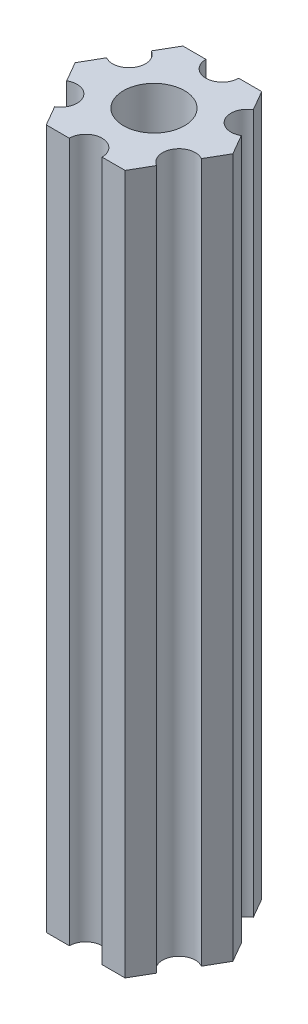
ISO-10303-21;
HEADER;
FILE_DESCRIPTION(('STEP AP214'),'2;1');
FILE_NAME('part.step','',(''),(''),'','','');
FILE_SCHEMA(('AUTOMOTIVE_DESIGN { 1 0 10303 214 1 1 1 1 }'));
ENDSEC;
DATA;
#1=APPLICATION_CONTEXT('core data for automotive mechanical design processes');
#2=APPLICATION_PROTOCOL_DEFINITION('international standard','automotive_design',2000,#1);
#3=PRODUCT_CONTEXT('',#1,'mechanical');
#4=PRODUCT('Part','Part','',(#3));
#5=PRODUCT_RELATED_PRODUCT_CATEGORY('part','',(#4));
#6=PRODUCT_DEFINITION_FORMATION('','',#4);
#7=PRODUCT_DEFINITION_CONTEXT('part definition',#1,'design');
#8=PRODUCT_DEFINITION('design','',#6,#7);
#9=PRODUCT_DEFINITION_SHAPE('','',#8);
#10=(LENGTH_UNIT() NAMED_UNIT(*) SI_UNIT(.MILLI.,.METRE.));
#11=(NAMED_UNIT(*) PLANE_ANGLE_UNIT() SI_UNIT($,.RADIAN.));
#12=(NAMED_UNIT(*) SI_UNIT($,.STERADIAN.) SOLID_ANGLE_UNIT());
#13=UNCERTAINTY_MEASURE_WITH_UNIT(LENGTH_MEASURE(1.E-05),#10,'distance_accuracy_value','');
#14=(GEOMETRIC_REPRESENTATION_CONTEXT(3) GLOBAL_UNCERTAINTY_ASSIGNED_CONTEXT((#13)) GLOBAL_UNIT_ASSIGNED_CONTEXT((#10,
#11,#12)) REPRESENTATION_CONTEXT('',''));
#15=CARTESIAN_POINT('',(0.,0.,0.));
#16=DIRECTION('',(0.,0.,1.));
#17=DIRECTION('',(1.,0.,0.));
#18=AXIS2_PLACEMENT_3D('',#15,#16,#17);
#19=CARTESIAN_POINT('',(5.41265877365274,21.,3.125));
#20=DIRECTION('',(0.,1.,0.));
#21=DIRECTION('',(0.,0.,1.));
#22=AXIS2_PLACEMENT_3D('',#19,#20,#21);
#23=CYLINDRICAL_SURFACE('',#22,1.5);
#24=CARTESIAN_POINT('',(5.41265877365274,85.,3.125));
#25=DIRECTION('',(0.,-1.,0.));
#26=DIRECTION('',(0.,0.,-1.));
#27=AXIS2_PLACEMENT_3D('',#24,#25,#26);
#28=CIRCLE('',#27,1.5);
#29=CARTESIAN_POINT('',(4.66265877365274,85.,4.42403810567666));
#30=VERTEX_POINT('',#29);
#31=CARTESIAN_POINT('',(6.16265877365274,85.,1.82596189432335));
#32=VERTEX_POINT('',#31);
#33=EDGE_CURVE('E189',#30,#32,#28,.T.);
#34=ORIENTED_EDGE('',*,*,#33,.F.);
#35=DIRECTION('',(0.,1.,0.));
#36=VECTOR('',#35,1.);
#37=CARTESIAN_POINT('',(4.66265877365274,21.,4.42403810567666));
#38=LINE('',#37,#36);
#39=CARTESIAN_POINT('',(4.66265877365274,21.,4.42403810567666));
#40=VERTEX_POINT('',#39);
#41=EDGE_CURVE('E11',#40,#30,#38,.T.);
#42=ORIENTED_EDGE('',*,*,#41,.F.);
#43=CARTESIAN_POINT('',(5.41265877365274,21.,3.125));
#44=DIRECTION('',(0.,-1.,0.));
#45=DIRECTION('',(0.,0.,-1.));
#46=AXIS2_PLACEMENT_3D('',#43,#44,#45);
#47=CIRCLE('',#46,1.5);
#48=CARTESIAN_POINT('',(6.16265877365274,21.,1.82596189432335));
#49=VERTEX_POINT('',#48);
#50=EDGE_CURVE('E240',#40,#49,#47,.T.);
#51=ORIENTED_EDGE('',*,*,#50,.T.);
#52=DIRECTION('',(0.,1.,0.));
#53=VECTOR('',#52,1.);
#54=CARTESIAN_POINT('',(6.16265877365274,21.,1.82596189432335));
#55=LINE('',#54,#53);
#56=EDGE_CURVE('E35',#49,#32,#55,.T.);
#57=ORIENTED_EDGE('',*,*,#56,.T.);
#58=EDGE_LOOP('',(#34,#42,#51,#57));
#59=FACE_BOUND('',#58,.T.);
#60=ADVANCED_FACE('F32',(#59),#23,.F.);
#61=CARTESIAN_POINT('',(3.60843918243516,21.,6.25));
#62=DIRECTION('',(0.866025403784439,0.,0.5));
#63=DIRECTION('',(0.5,0.,-0.866025403784439));
#64=AXIS2_PLACEMENT_3D('',#61,#62,#63);
#65=PLANE('',#64);
#66=DIRECTION('',(0.5,0.,-0.866025403784439));
#67=VECTOR('',#66,1.);
#68=CARTESIAN_POINT('',(3.60843918243516,85.,6.25));
#69=LINE('',#68,#67);
#70=CARTESIAN_POINT('',(3.60843918243516,85.,6.25));
#71=VERTEX_POINT('',#70);
#72=EDGE_CURVE('E238',#71,#30,#69,.T.);
#73=ORIENTED_EDGE('',*,*,#72,.F.);
#74=DIRECTION('',(0.,1.,0.));
#75=VECTOR('',#74,1.);
#76=CARTESIAN_POINT('',(3.60843918243516,21.,6.25));
#77=LINE('',#76,#75);
#78=CARTESIAN_POINT('',(3.60843918243516,21.,6.25));
#79=VERTEX_POINT('',#78);
#80=EDGE_CURVE('E41',#79,#71,#77,.T.);
#81=ORIENTED_EDGE('',*,*,#80,.F.);
#82=DIRECTION('',(0.5,0.,-0.866025403784439));
#83=VECTOR('',#82,1.);
#84=CARTESIAN_POINT('',(3.60843918243516,21.,6.25));
#85=LINE('',#84,#83);
#86=EDGE_CURVE('E179',#79,#40,#85,.T.);
#87=ORIENTED_EDGE('',*,*,#86,.T.);
#88=ORIENTED_EDGE('',*,*,#41,.T.);
#89=EDGE_LOOP('',(#73,#81,#87,#88));
#90=FACE_BOUND('',#89,.T.);
#91=ADVANCED_FACE('F272',(#90),#65,.T.);
#92=CARTESIAN_POINT('',(1.5,21.,6.25));
#93=DIRECTION('',(0.,0.,1.));
#94=DIRECTION('',(1.,0.,0.));
#95=AXIS2_PLACEMENT_3D('',#92,#93,#94);
#96=PLANE('',#95);
#97=DIRECTION('',(1.,0.,0.));
#98=VECTOR('',#97,1.);
#99=CARTESIAN_POINT('',(1.5,85.,6.25));
#100=LINE('',#99,#98);
#101=CARTESIAN_POINT('',(1.5,85.,6.25));
#102=VERTEX_POINT('',#101);
#103=EDGE_CURVE('E166',#102,#71,#100,.T.);
#104=ORIENTED_EDGE('',*,*,#103,.F.);
#105=DIRECTION('',(0.,1.,0.));
#106=VECTOR('',#105,1.);
#107=CARTESIAN_POINT('',(1.5,21.,6.25));
#108=LINE('',#107,#106);
#109=CARTESIAN_POINT('',(1.5,21.,6.25));
#110=VERTEX_POINT('',#109);
#111=EDGE_CURVE('E161',#110,#102,#108,.T.);
#112=ORIENTED_EDGE('',*,*,#111,.F.);
#113=DIRECTION('',(1.,0.,0.));
#114=VECTOR('',#113,1.);
#115=CARTESIAN_POINT('',(1.5,21.,6.25));
#116=LINE('',#115,#114);
#117=EDGE_CURVE('E164',#110,#79,#116,.T.);
#118=ORIENTED_EDGE('',*,*,#117,.T.);
#119=ORIENTED_EDGE('',*,*,#80,.T.);
#120=EDGE_LOOP('',(#104,#112,#118,#119));
#121=FACE_BOUND('',#120,.T.);
#122=ADVANCED_FACE('F163',(#121),#96,.T.);
#123=CARTESIAN_POINT('',(0.,21.,6.25));
#124=DIRECTION('',(0.,1.,0.));
#125=DIRECTION('',(0.,0.,1.));
#126=AXIS2_PLACEMENT_3D('',#123,#124,#125);
#127=CYLINDRICAL_SURFACE('',#126,1.5);
#128=CARTESIAN_POINT('',(0.,85.,6.25));
#129=DIRECTION('',(0.,-1.,0.));
#130=DIRECTION('',(0.,0.,-1.));
#131=AXIS2_PLACEMENT_3D('',#128,#129,#130);
#132=CIRCLE('',#131,1.5);
#133=CARTESIAN_POINT('',(-1.5,85.,6.25));
#134=VERTEX_POINT('',#133);
#135=EDGE_CURVE('E235',#134,#102,#132,.T.);
#136=ORIENTED_EDGE('',*,*,#135,.F.);
#137=DIRECTION('',(0.,1.,0.));
#138=VECTOR('',#137,1.);
#139=CARTESIAN_POINT('',(-1.5,21.,6.25));
#140=LINE('',#139,#138);
#141=CARTESIAN_POINT('',(-1.5,21.,6.25));
#142=VERTEX_POINT('',#141);
#143=EDGE_CURVE('E171',#142,#134,#140,.T.);
#144=ORIENTED_EDGE('',*,*,#143,.F.);
#145=CARTESIAN_POINT('',(0.,21.,6.25));
#146=DIRECTION('',(0.,-1.,0.));
#147=DIRECTION('',(0.,0.,-1.));
#148=AXIS2_PLACEMENT_3D('',#145,#146,#147);
#149=CIRCLE('',#148,1.5);
#150=EDGE_CURVE('E177',#142,#110,#149,.T.);
#151=ORIENTED_EDGE('',*,*,#150,.T.);
#152=ORIENTED_EDGE('',*,*,#111,.T.);
#153=EDGE_LOOP('',(#136,#144,#151,#152));
#154=FACE_BOUND('',#153,.T.);
#155=ADVANCED_FACE('F181',(#154),#127,.F.);
#156=CARTESIAN_POINT('',(-3.60843918243516,21.,6.25));
#157=DIRECTION('',(0.,0.,1.));
#158=DIRECTION('',(1.,0.,0.));
#159=AXIS2_PLACEMENT_3D('',#156,#157,#158);
#160=PLANE('',#159);
#161=DIRECTION('',(1.,0.,0.));
#162=VECTOR('',#161,1.);
#163=CARTESIAN_POINT('',(-3.60843918243516,85.,6.25));
#164=LINE('',#163,#162);
#165=CARTESIAN_POINT('',(-3.60843918243516,85.,6.25));
#166=VERTEX_POINT('',#165);
#167=EDGE_CURVE('E232',#166,#134,#164,.T.);
#168=ORIENTED_EDGE('',*,*,#167,.F.);
#169=DIRECTION('',(0.,1.,0.));
#170=VECTOR('',#169,1.);
#171=CARTESIAN_POINT('',(-3.60843918243516,21.,6.25));
#172=LINE('',#171,#170);
#173=CARTESIAN_POINT('',(-3.60843918243516,21.,6.25));
#174=VERTEX_POINT('',#173);
#175=EDGE_CURVE('E244',#174,#166,#172,.T.);
#176=ORIENTED_EDGE('',*,*,#175,.F.);
#177=DIRECTION('',(1.,0.,0.));
#178=VECTOR('',#177,1.);
#179=CARTESIAN_POINT('',(-3.60843918243516,21.,6.25));
#180=LINE('',#179,#178);
#181=EDGE_CURVE('E182',#174,#142,#180,.T.);
#182=ORIENTED_EDGE('',*,*,#181,.T.);
#183=ORIENTED_EDGE('',*,*,#143,.T.);
#184=EDGE_LOOP('',(#168,#176,#182,#183));
#185=FACE_BOUND('',#184,.T.);
#186=ADVANCED_FACE('F285',(#185),#160,.T.);
#187=CARTESIAN_POINT('',(-4.66265877365274,21.,4.42403810567666));
#188=DIRECTION('',(-0.866025403784439,0.,0.5));
#189=DIRECTION('',(0.5,0.,0.866025403784439));
#190=AXIS2_PLACEMENT_3D('',#187,#188,#189);
#191=PLANE('',#190);
#192=DIRECTION('',(0.5,0.,0.866025403784439));
#193=VECTOR('',#192,1.);
#194=CARTESIAN_POINT('',(-4.66265877365274,85.,4.42403810567666));
#195=LINE('',#194,#193);
#196=CARTESIAN_POINT('',(-4.66265877365274,85.,4.42403810567666));
#197=VERTEX_POINT('',#196);
#198=EDGE_CURVE('E229',#197,#166,#195,.T.);
#199=ORIENTED_EDGE('',*,*,#198,.F.);
#200=DIRECTION('',(0.,1.,0.));
#201=VECTOR('',#200,1.);
#202=CARTESIAN_POINT('',(-4.66265877365274,21.,4.42403810567666));
#203=LINE('',#202,#201);
#204=CARTESIAN_POINT('',(-4.66265877365274,21.,4.42403810567666));
#205=VERTEX_POINT('',#204);
#206=EDGE_CURVE('E246',#205,#197,#203,.T.);
#207=ORIENTED_EDGE('',*,*,#206,.F.);
#208=DIRECTION('',(0.5,0.,0.866025403784439));
#209=VECTOR('',#208,1.);
#210=CARTESIAN_POINT('',(-4.66265877365274,21.,4.42403810567666));
#211=LINE('',#210,#209);
#212=EDGE_CURVE('E184',#205,#174,#211,.T.);
#213=ORIENTED_EDGE('',*,*,#212,.T.);
#214=ORIENTED_EDGE('',*,*,#175,.T.);
#215=EDGE_LOOP('',(#199,#207,#213,#214));
#216=FACE_BOUND('',#215,.T.);
#217=ADVANCED_FACE('F288',(#216),#191,.T.);
#218=CARTESIAN_POINT('',(-5.41265877365274,21.,3.125));
#219=DIRECTION('',(0.,1.,0.));
#220=DIRECTION('',(0.,0.,1.));
#221=AXIS2_PLACEMENT_3D('',#218,#219,#220);
#222=CYLINDRICAL_SURFACE('',#221,1.5);
#223=CARTESIAN_POINT('',(-5.41265877365274,85.,3.125));
#224=DIRECTION('',(0.,-1.,0.));
#225=DIRECTION('',(0.,0.,-1.));
#226=AXIS2_PLACEMENT_3D('',#223,#224,#225);
#227=CIRCLE('',#226,1.5);
#228=CARTESIAN_POINT('',(-6.16265877365274,85.,1.82596189432335));
#229=VERTEX_POINT('',#228);
#230=EDGE_CURVE('E226',#229,#197,#227,.T.);
#231=ORIENTED_EDGE('',*,*,#230,.F.);
#232=DIRECTION('',(0.,1.,0.));
#233=VECTOR('',#232,1.);
#234=CARTESIAN_POINT('',(-6.16265877365274,21.,1.82596189432335));
#235=LINE('',#234,#233);
#236=CARTESIAN_POINT('',(-6.16265877365274,21.,1.82596189432335));
#237=VERTEX_POINT('',#236);
#238=EDGE_CURVE('E248',#237,#229,#235,.T.);
#239=ORIENTED_EDGE('',*,*,#238,.F.);
#240=CARTESIAN_POINT('',(-5.41265877365274,21.,3.125));
#241=DIRECTION('',(0.,-1.,0.));
#242=DIRECTION('',(0.,0.,-1.));
#243=AXIS2_PLACEMENT_3D('',#240,#241,#242);
#244=CIRCLE('',#243,1.5);
#245=EDGE_CURVE('E393',#237,#205,#244,.T.);
#246=ORIENTED_EDGE('',*,*,#245,.T.);
#247=ORIENTED_EDGE('',*,*,#206,.T.);
#248=EDGE_LOOP('',(#231,#239,#246,#247));
#249=FACE_BOUND('',#248,.T.);
#250=ADVANCED_FACE('F292',(#249),#222,.F.);
#251=CARTESIAN_POINT('',(-7.21687836487032,21.,0.));
#252=DIRECTION('',(-0.86602540378444,0.,0.499999999999998));
#253=DIRECTION('',(0.499999999999998,0.,0.86602540378444));
#254=AXIS2_PLACEMENT_3D('',#251,#252,#253);
#255=PLANE('',#254);
#256=DIRECTION('',(0.499999999999998,0.,0.86602540378444));
#257=VECTOR('',#256,1.);
#258=CARTESIAN_POINT('',(-7.21687836487032,85.,0.));
#259=LINE('',#258,#257);
#260=CARTESIAN_POINT('',(-7.21687836487032,85.,0.));
#261=VERTEX_POINT('',#260);
#262=EDGE_CURVE('E223',#261,#229,#259,.T.);
#263=ORIENTED_EDGE('',*,*,#262,.F.);
#264=DIRECTION('',(0.,1.,0.));
#265=VECTOR('',#264,1.);
#266=CARTESIAN_POINT('',(-7.21687836487032,21.,0.));
#267=LINE('',#266,#265);
#268=CARTESIAN_POINT('',(-7.21687836487032,21.,0.));
#269=VERTEX_POINT('',#268);
#270=EDGE_CURVE('E250',#269,#261,#267,.T.);
#271=ORIENTED_EDGE('',*,*,#270,.F.);
#272=DIRECTION('',(0.499999999999998,0.,0.86602540378444));
#273=VECTOR('',#272,1.);
#274=CARTESIAN_POINT('',(-7.21687836487032,21.,0.));
#275=LINE('',#274,#273);
#276=EDGE_CURVE('E390',#269,#237,#275,.T.);
#277=ORIENTED_EDGE('',*,*,#276,.T.);
#278=ORIENTED_EDGE('',*,*,#238,.T.);
#279=EDGE_LOOP('',(#263,#271,#277,#278));
#280=FACE_BOUND('',#279,.T.);
#281=ADVANCED_FACE('F296',(#280),#255,.T.);
#282=CARTESIAN_POINT('',(-6.16265877365274,21.,-1.82596189432334));
#283=DIRECTION('',(-0.866025403784438,0.,-0.5));
#284=DIRECTION('',(-0.5,0.,0.866025403784438));
#285=AXIS2_PLACEMENT_3D('',#282,#283,#284);
#286=PLANE('',#285);
#287=DIRECTION('',(-0.5,0.,0.866025403784438));
#288=VECTOR('',#287,1.);
#289=CARTESIAN_POINT('',(-6.16265877365274,85.,-1.82596189432334));
#290=LINE('',#289,#288);
#291=CARTESIAN_POINT('',(-6.16265877365274,85.,-1.82596189432334));
#292=VERTEX_POINT('',#291);
#293=EDGE_CURVE('E220',#292,#261,#290,.T.);
#294=ORIENTED_EDGE('',*,*,#293,.F.);
#295=DIRECTION('',(0.,1.,0.));
#296=VECTOR('',#295,1.);
#297=CARTESIAN_POINT('',(-6.16265877365274,21.,-1.82596189432334));
#298=LINE('',#297,#296);
#299=CARTESIAN_POINT('',(-6.16265877365274,21.,-1.82596189432334));
#300=VERTEX_POINT('',#299);
#301=EDGE_CURVE('E252',#300,#292,#298,.T.);
#302=ORIENTED_EDGE('',*,*,#301,.F.);
#303=DIRECTION('',(-0.5,0.,0.866025403784438));
#304=VECTOR('',#303,1.);
#305=CARTESIAN_POINT('',(-6.16265877365274,21.,-1.82596189432334));
#306=LINE('',#305,#304);
#307=EDGE_CURVE('E387',#300,#269,#306,.T.);
#308=ORIENTED_EDGE('',*,*,#307,.T.);
#309=ORIENTED_EDGE('',*,*,#270,.T.);
#310=EDGE_LOOP('',(#294,#302,#308,#309));
#311=FACE_BOUND('',#310,.T.);
#312=ADVANCED_FACE('F300',(#311),#286,.T.);
#313=CARTESIAN_POINT('',(-5.41265877365274,21.,-3.125));
#314=DIRECTION('',(0.,1.,0.));
#315=DIRECTION('',(0.,0.,1.));
#316=AXIS2_PLACEMENT_3D('',#313,#314,#315);
#317=CYLINDRICAL_SURFACE('',#316,1.5);
#318=CARTESIAN_POINT('',(-5.41265877365274,85.,-3.125));
#319=DIRECTION('',(0.,-1.,0.));
#320=DIRECTION('',(0.,0.,-1.));
#321=AXIS2_PLACEMENT_3D('',#318,#319,#320);
#322=CIRCLE('',#321,1.5);
#323=CARTESIAN_POINT('',(-4.66265877365274,85.,-4.42403810567666));
#324=VERTEX_POINT('',#323);
#325=EDGE_CURVE('E217',#324,#292,#322,.T.);
#326=ORIENTED_EDGE('',*,*,#325,.F.);
#327=DIRECTION('',(0.,1.,0.));
#328=VECTOR('',#327,1.);
#329=CARTESIAN_POINT('',(-4.66265877365274,21.,-4.42403810567666));
#330=LINE('',#329,#328);
#331=CARTESIAN_POINT('',(-4.66265877365274,21.,-4.42403810567666));
#332=VERTEX_POINT('',#331);
#333=EDGE_CURVE('E254',#332,#324,#330,.T.);
#334=ORIENTED_EDGE('',*,*,#333,.F.);
#335=CARTESIAN_POINT('',(-5.41265877365274,21.,-3.125));
#336=DIRECTION('',(0.,-1.,0.));
#337=DIRECTION('',(0.,0.,-1.));
#338=AXIS2_PLACEMENT_3D('',#335,#336,#337);
#339=CIRCLE('',#338,1.5);
#340=EDGE_CURVE('E384',#332,#300,#339,.T.);
#341=ORIENTED_EDGE('',*,*,#340,.T.);
#342=ORIENTED_EDGE('',*,*,#301,.T.);
#343=EDGE_LOOP('',(#326,#334,#341,#342));
#344=FACE_BOUND('',#343,.T.);
#345=ADVANCED_FACE('F304',(#344),#317,.F.);
#346=CARTESIAN_POINT('',(-3.60843918243516,21.,-6.25));
#347=DIRECTION('',(-0.866025403784439,0.,-0.5));
#348=DIRECTION('',(-0.5,0.,0.866025403784439));
#349=AXIS2_PLACEMENT_3D('',#346,#347,#348);
#350=PLANE('',#349);
#351=DIRECTION('',(-0.5,0.,0.866025403784439));
#352=VECTOR('',#351,1.);
#353=CARTESIAN_POINT('',(-3.60843918243516,85.,-6.25));
#354=LINE('',#353,#352);
#355=CARTESIAN_POINT('',(-3.60843918243516,85.,-6.25));
#356=VERTEX_POINT('',#355);
#357=EDGE_CURVE('E214',#356,#324,#354,.T.);
#358=ORIENTED_EDGE('',*,*,#357,.F.);
#359=DIRECTION('',(0.,1.,0.));
#360=VECTOR('',#359,1.);
#361=CARTESIAN_POINT('',(-3.60843918243516,21.,-6.25));
#362=LINE('',#361,#360);
#363=CARTESIAN_POINT('',(-3.60843918243516,21.,-6.25));
#364=VERTEX_POINT('',#363);
#365=EDGE_CURVE('E256',#364,#356,#362,.T.);
#366=ORIENTED_EDGE('',*,*,#365,.F.);
#367=DIRECTION('',(-0.5,0.,0.866025403784439));
#368=VECTOR('',#367,1.);
#369=CARTESIAN_POINT('',(-3.60843918243516,21.,-6.25));
#370=LINE('',#369,#368);
#371=EDGE_CURVE('E381',#364,#332,#370,.T.);
#372=ORIENTED_EDGE('',*,*,#371,.T.);
#373=ORIENTED_EDGE('',*,*,#333,.T.);
#374=EDGE_LOOP('',(#358,#366,#372,#373));
#375=FACE_BOUND('',#374,.T.);
#376=ADVANCED_FACE('F308',(#375),#350,.T.);
#377=CARTESIAN_POINT('',(-1.5,21.,-6.25));
#378=DIRECTION('',(0.,0.,-1.));
#379=DIRECTION('',(-1.,0.,0.));
#380=AXIS2_PLACEMENT_3D('',#377,#378,#379);
#381=PLANE('',#380);
#382=DIRECTION('',(-1.,0.,0.));
#383=VECTOR('',#382,1.);
#384=CARTESIAN_POINT('',(-1.5,85.,-6.25));
#385=LINE('',#384,#383);
#386=CARTESIAN_POINT('',(-1.5,85.,-6.25));
#387=VERTEX_POINT('',#386);
#388=EDGE_CURVE('E211',#387,#356,#385,.T.);
#389=ORIENTED_EDGE('',*,*,#388,.F.);
#390=DIRECTION('',(0.,1.,0.));
#391=VECTOR('',#390,1.);
#392=CARTESIAN_POINT('',(-1.5,21.,-6.25));
#393=LINE('',#392,#391);
#394=CARTESIAN_POINT('',(-1.5,21.,-6.25));
#395=VERTEX_POINT('',#394);
#396=EDGE_CURVE('E258',#395,#387,#393,.T.);
#397=ORIENTED_EDGE('',*,*,#396,.F.);
#398=DIRECTION('',(-1.,0.,0.));
#399=VECTOR('',#398,1.);
#400=CARTESIAN_POINT('',(-1.5,21.,-6.25));
#401=LINE('',#400,#399);
#402=EDGE_CURVE('E378',#395,#364,#401,.T.);
#403=ORIENTED_EDGE('',*,*,#402,.T.);
#404=ORIENTED_EDGE('',*,*,#365,.T.);
#405=EDGE_LOOP('',(#389,#397,#403,#404));
#406=FACE_BOUND('',#405,.T.);
#407=ADVANCED_FACE('F312',(#406),#381,.T.);
#408=CARTESIAN_POINT('',(0.,21.,-6.25));
#409=DIRECTION('',(0.,1.,0.));
#410=DIRECTION('',(0.,0.,1.));
#411=AXIS2_PLACEMENT_3D('',#408,#409,#410);
#412=CYLINDRICAL_SURFACE('',#411,1.5);
#413=CARTESIAN_POINT('',(0.,85.,-6.25));
#414=DIRECTION('',(0.,-1.,0.));
#415=DIRECTION('',(0.,0.,-1.));
#416=AXIS2_PLACEMENT_3D('',#413,#414,#415);
#417=CIRCLE('',#416,1.5);
#418=CARTESIAN_POINT('',(1.5,85.,-6.25));
#419=VERTEX_POINT('',#418);
#420=EDGE_CURVE('E208',#419,#387,#417,.T.);
#421=ORIENTED_EDGE('',*,*,#420,.F.);
#422=DIRECTION('',(0.,1.,0.));
#423=VECTOR('',#422,1.);
#424=CARTESIAN_POINT('',(1.5,21.,-6.25));
#425=LINE('',#424,#423);
#426=CARTESIAN_POINT('',(1.5,21.,-6.25));
#427=VERTEX_POINT('',#426);
#428=EDGE_CURVE('E260',#427,#419,#425,.T.);
#429=ORIENTED_EDGE('',*,*,#428,.F.);
#430=CARTESIAN_POINT('',(0.,21.,-6.25));
#431=DIRECTION('',(0.,-1.,0.));
#432=DIRECTION('',(0.,0.,-1.));
#433=AXIS2_PLACEMENT_3D('',#430,#431,#432);
#434=CIRCLE('',#433,1.5);
#435=EDGE_CURVE('E375',#427,#395,#434,.T.);
#436=ORIENTED_EDGE('',*,*,#435,.T.);
#437=ORIENTED_EDGE('',*,*,#396,.T.);
#438=EDGE_LOOP('',(#421,#429,#436,#437));
#439=FACE_BOUND('',#438,.T.);
#440=ADVANCED_FACE('F316',(#439),#412,.F.);
#441=CARTESIAN_POINT('',(3.60843918243516,21.,-6.25));
#442=DIRECTION('',(0.,0.,-1.));
#443=DIRECTION('',(-1.,0.,0.));
#444=AXIS2_PLACEMENT_3D('',#441,#442,#443);
#445=PLANE('',#444);
#446=DIRECTION('',(-1.,0.,0.));
#447=VECTOR('',#446,1.);
#448=CARTESIAN_POINT('',(3.60843918243516,85.,-6.25));
#449=LINE('',#448,#447);
#450=CARTESIAN_POINT('',(3.60843918243516,85.,-6.25));
#451=VERTEX_POINT('',#450);
#452=EDGE_CURVE('E205',#451,#419,#449,.T.);
#453=ORIENTED_EDGE('',*,*,#452,.F.);
#454=DIRECTION('',(0.,1.,0.));
#455=VECTOR('',#454,1.);
#456=CARTESIAN_POINT('',(3.60843918243516,21.,-6.25));
#457=LINE('',#456,#455);
#458=CARTESIAN_POINT('',(3.60843918243516,21.,-6.25));
#459=VERTEX_POINT('',#458);
#460=EDGE_CURVE('E262',#459,#451,#457,.T.);
#461=ORIENTED_EDGE('',*,*,#460,.F.);
#462=DIRECTION('',(-1.,0.,0.));
#463=VECTOR('',#462,1.);
#464=CARTESIAN_POINT('',(3.60843918243516,21.,-6.25));
#465=LINE('',#464,#463);
#466=EDGE_CURVE('E372',#459,#427,#465,.T.);
#467=ORIENTED_EDGE('',*,*,#466,.T.);
#468=ORIENTED_EDGE('',*,*,#428,.T.);
#469=EDGE_LOOP('',(#453,#461,#467,#468));
#470=FACE_BOUND('',#469,.T.);
#471=ADVANCED_FACE('F320',(#470),#445,.T.);
#472=CARTESIAN_POINT('',(4.66265877365274,21.,-4.42403810567666));
#473=DIRECTION('',(0.866025403784439,0.,-0.5));
#474=DIRECTION('',(-0.5,0.,-0.866025403784439));
#475=AXIS2_PLACEMENT_3D('',#472,#473,#474);
#476=PLANE('',#475);
#477=DIRECTION('',(-0.5,0.,-0.866025403784439));
#478=VECTOR('',#477,1.);
#479=CARTESIAN_POINT('',(4.66265877365274,85.,-4.42403810567666));
#480=LINE('',#479,#478);
#481=CARTESIAN_POINT('',(4.66265877365274,85.,-4.42403810567666));
#482=VERTEX_POINT('',#481);
#483=EDGE_CURVE('E202',#482,#451,#480,.T.);
#484=ORIENTED_EDGE('',*,*,#483,.F.);
#485=DIRECTION('',(0.,1.,0.));
#486=VECTOR('',#485,1.);
#487=CARTESIAN_POINT('',(4.66265877365274,21.,-4.42403810567666));
#488=LINE('',#487,#486);
#489=CARTESIAN_POINT('',(4.66265877365274,21.,-4.42403810567666));
#490=VERTEX_POINT('',#489);
#491=EDGE_CURVE('E264',#490,#482,#488,.T.);
#492=ORIENTED_EDGE('',*,*,#491,.F.);
#493=DIRECTION('',(-0.5,0.,-0.866025403784439));
#494=VECTOR('',#493,1.);
#495=CARTESIAN_POINT('',(4.66265877365274,21.,-4.42403810567666));
#496=LINE('',#495,#494);
#497=EDGE_CURVE('E369',#490,#459,#496,.T.);
#498=ORIENTED_EDGE('',*,*,#497,.T.);
#499=ORIENTED_EDGE('',*,*,#460,.T.);
#500=EDGE_LOOP('',(#484,#492,#498,#499));
#501=FACE_BOUND('',#500,.T.);
#502=ADVANCED_FACE('F324',(#501),#476,.T.);
#503=CARTESIAN_POINT('',(5.41265877365274,21.,-3.125));
#504=DIRECTION('',(0.,1.,0.));
#505=DIRECTION('',(0.,0.,1.));
#506=AXIS2_PLACEMENT_3D('',#503,#504,#505);
#507=CYLINDRICAL_SURFACE('',#506,1.5);
#508=CARTESIAN_POINT('',(5.41265877365274,85.,-3.125));
#509=DIRECTION('',(0.,-1.,0.));
#510=DIRECTION('',(0.,0.,-1.));
#511=AXIS2_PLACEMENT_3D('',#508,#509,#510);
#512=CIRCLE('',#511,1.5);
#513=CARTESIAN_POINT('',(6.16265877365274,85.,-1.82596189432334));
#514=VERTEX_POINT('',#513);
#515=EDGE_CURVE('E199',#514,#482,#512,.T.);
#516=ORIENTED_EDGE('',*,*,#515,.F.);
#517=DIRECTION('',(0.,1.,0.));
#518=VECTOR('',#517,1.);
#519=CARTESIAN_POINT('',(6.16265877365274,21.,-1.82596189432334));
#520=LINE('',#519,#518);
#521=CARTESIAN_POINT('',(6.16265877365274,21.,-1.82596189432334));
#522=VERTEX_POINT('',#521);
#523=EDGE_CURVE('E266',#522,#514,#520,.T.);
#524=ORIENTED_EDGE('',*,*,#523,.F.);
#525=CARTESIAN_POINT('',(5.41265877365274,21.,-3.125));
#526=DIRECTION('',(0.,-1.,0.));
#527=DIRECTION('',(0.,0.,-1.));
#528=AXIS2_PLACEMENT_3D('',#525,#526,#527);
#529=CIRCLE('',#528,1.5);
#530=EDGE_CURVE('E366',#522,#490,#529,.T.);
#531=ORIENTED_EDGE('',*,*,#530,.T.);
#532=ORIENTED_EDGE('',*,*,#491,.T.);
#533=EDGE_LOOP('',(#516,#524,#531,#532));
#534=FACE_BOUND('',#533,.T.);
#535=ADVANCED_FACE('F328',(#534),#507,.F.);
#536=CARTESIAN_POINT('',(7.21687836487032,21.,0.));
#537=DIRECTION('',(0.866025403784439,0.,-0.5));
#538=DIRECTION('',(-0.5,0.,-0.866025403784439));
#539=AXIS2_PLACEMENT_3D('',#536,#537,#538);
#540=PLANE('',#539);
#541=DIRECTION('',(-0.5,0.,-0.866025403784439));
#542=VECTOR('',#541,1.);
#543=CARTESIAN_POINT('',(7.21687836487032,85.,0.));
#544=LINE('',#543,#542);
#545=CARTESIAN_POINT('',(7.21687836487032,85.,0.));
#546=VERTEX_POINT('',#545);
#547=EDGE_CURVE('E196',#546,#514,#544,.T.);
#548=ORIENTED_EDGE('',*,*,#547,.F.);
#549=DIRECTION('',(0.,1.,0.));
#550=VECTOR('',#549,1.);
#551=CARTESIAN_POINT('',(7.21687836487032,21.,0.));
#552=LINE('',#551,#550);
#553=CARTESIAN_POINT('',(7.21687836487032,21.,0.));
#554=VERTEX_POINT('',#553);
#555=EDGE_CURVE('E267',#554,#546,#552,.T.);
#556=ORIENTED_EDGE('',*,*,#555,.F.);
#557=DIRECTION('',(-0.5,0.,-0.866025403784439));
#558=VECTOR('',#557,1.);
#559=CARTESIAN_POINT('',(7.21687836487032,21.,0.));
#560=LINE('',#559,#558);
#561=EDGE_CURVE('E363',#554,#522,#560,.T.);
#562=ORIENTED_EDGE('',*,*,#561,.T.);
#563=ORIENTED_EDGE('',*,*,#523,.T.);
#564=EDGE_LOOP('',(#548,#556,#562,#563));
#565=FACE_BOUND('',#564,.T.);
#566=ADVANCED_FACE('F332',(#565),#540,.T.);
#567=CARTESIAN_POINT('',(6.16265877365274,21.,1.82596189432335));
#568=DIRECTION('',(0.86602540378444,0.,0.499999999999999));
#569=DIRECTION('',(0.499999999999999,0.,-0.86602540378444));
#570=AXIS2_PLACEMENT_3D('',#567,#568,#569);
#571=PLANE('',#570);
#572=DIRECTION('',(0.499999999999999,0.,-0.86602540378444));
#573=VECTOR('',#572,1.);
#574=CARTESIAN_POINT('',(6.16265877365274,85.,1.82596189432335));
#575=LINE('',#574,#573);
#576=EDGE_CURVE('E192',#32,#546,#575,.T.);
#577=ORIENTED_EDGE('',*,*,#576,.F.);
#578=ORIENTED_EDGE('',*,*,#56,.F.);
#579=DIRECTION('',(0.499999999999999,0.,-0.86602540378444));
#580=VECTOR('',#579,1.);
#581=CARTESIAN_POINT('',(6.16265877365274,21.,1.82596189432335));
#582=LINE('',#581,#580);
#583=EDGE_CURVE('E361',#49,#554,#582,.T.);
#584=ORIENTED_EDGE('',*,*,#583,.T.);
#585=ORIENTED_EDGE('',*,*,#555,.T.);
#586=EDGE_LOOP('',(#577,#578,#584,#585));
#587=FACE_BOUND('',#586,.T.);
#588=ADVANCED_FACE('F269',(#587),#571,.T.);
#589=CARTESIAN_POINT('',(5.41265877365274,21.,3.125));
#590=DIRECTION('',(0.,-1.,0.));
#591=DIRECTION('',(0.,0.,-1.));
#592=AXIS2_PLACEMENT_3D('',#589,#590,#591);
#593=PLANE('',#592);
#594=CARTESIAN_POINT('',(0.,21.,0.));
#595=DIRECTION('',(0.,1.,0.));
#596=DIRECTION('',(0.,0.,-1.));
#597=AXIS2_PLACEMENT_3D('',#594,#595,#596);
#598=CIRCLE('',#597,2.79);
#599=CARTESIAN_POINT('',(0.,21.,-2.79));
#600=VERTEX_POINT('',#599);
#601=EDGE_CURVE('E193',#600,#600,#598,.T.);
#602=ORIENTED_EDGE('',*,*,#601,.T.);
#603=EDGE_LOOP('',(#602));
#604=FACE_BOUND('',#603,.T.);
#605=ORIENTED_EDGE('',*,*,#50,.F.);
#606=ORIENTED_EDGE('',*,*,#86,.F.);
#607=ORIENTED_EDGE('',*,*,#117,.F.);
#608=ORIENTED_EDGE('',*,*,#150,.F.);
#609=ORIENTED_EDGE('',*,*,#181,.F.);
#610=ORIENTED_EDGE('',*,*,#212,.F.);
#611=ORIENTED_EDGE('',*,*,#245,.F.);
#612=ORIENTED_EDGE('',*,*,#276,.F.);
#613=ORIENTED_EDGE('',*,*,#307,.F.);
#614=ORIENTED_EDGE('',*,*,#340,.F.);
#615=ORIENTED_EDGE('',*,*,#371,.F.);
#616=ORIENTED_EDGE('',*,*,#402,.F.);
#617=ORIENTED_EDGE('',*,*,#435,.F.);
#618=ORIENTED_EDGE('',*,*,#466,.F.);
#619=ORIENTED_EDGE('',*,*,#497,.F.);
#620=ORIENTED_EDGE('',*,*,#530,.F.);
#621=ORIENTED_EDGE('',*,*,#561,.F.);
#622=ORIENTED_EDGE('',*,*,#583,.F.);
#623=EDGE_LOOP('',(#605,#606,#607,#608,#609,#610,#611,#612,#613,#614,#615,#616,#617,#618,#619,
#620,#621,#622));
#624=FACE_BOUND('',#623,.T.);
#625=ADVANCED_FACE('F175',(#604,#624),#593,.T.);
#626=CARTESIAN_POINT('',(5.41265877365274,85.,3.125));
#627=DIRECTION('',(0.,-1.,0.));
#628=DIRECTION('',(0.,0.,-1.));
#629=AXIS2_PLACEMENT_3D('',#626,#627,#628);
#630=PLANE('',#629);
#631=CARTESIAN_POINT('',(0.,85.,0.));
#632=DIRECTION('',(0.,1.,0.));
#633=DIRECTION('',(0.,0.,-1.));
#634=AXIS2_PLACEMENT_3D('',#631,#632,#633);
#635=CIRCLE('',#634,2.79);
#636=CARTESIAN_POINT('',(0.,85.,-2.79));
#637=VERTEX_POINT('',#636);
#638=EDGE_CURVE('E356',#637,#637,#635,.T.);
#639=ORIENTED_EDGE('',*,*,#638,.F.);
#640=EDGE_LOOP('',(#639));
#641=FACE_BOUND('',#640,.T.);
#642=ORIENTED_EDGE('',*,*,#33,.T.);
#643=ORIENTED_EDGE('',*,*,#576,.T.);
#644=ORIENTED_EDGE('',*,*,#547,.T.);
#645=ORIENTED_EDGE('',*,*,#515,.T.);
#646=ORIENTED_EDGE('',*,*,#483,.T.);
#647=ORIENTED_EDGE('',*,*,#452,.T.);
#648=ORIENTED_EDGE('',*,*,#420,.T.);
#649=ORIENTED_EDGE('',*,*,#388,.T.);
#650=ORIENTED_EDGE('',*,*,#357,.T.);
#651=ORIENTED_EDGE('',*,*,#325,.T.);
#652=ORIENTED_EDGE('',*,*,#293,.T.);
#653=ORIENTED_EDGE('',*,*,#262,.T.);
#654=ORIENTED_EDGE('',*,*,#230,.T.);
#655=ORIENTED_EDGE('',*,*,#198,.T.);
#656=ORIENTED_EDGE('',*,*,#167,.T.);
#657=ORIENTED_EDGE('',*,*,#135,.T.);
#658=ORIENTED_EDGE('',*,*,#103,.T.);
#659=ORIENTED_EDGE('',*,*,#72,.T.);
#660=EDGE_LOOP('',(#642,#643,#644,#645,#646,#647,#648,#649,#650,#651,#652,#653,#654,#655,#656,
#657,#658,#659));
#661=FACE_BOUND('',#660,.T.);
#662=ADVANCED_FACE('F271',(#641,#661),#630,.F.);
#663=CARTESIAN_POINT('',(0.,21.,0.));
#664=DIRECTION('',(0.,1.,0.));
#665=DIRECTION('',(0.,0.,1.));
#666=AXIS2_PLACEMENT_3D('',#663,#664,#665);
#667=CYLINDRICAL_SURFACE('',#666,2.79);
#668=ORIENTED_EDGE('',*,*,#601,.F.);
#669=EDGE_LOOP('',(#668));
#670=FACE_BOUND('',#669,.T.);
#671=ORIENTED_EDGE('',*,*,#638,.T.);
#672=EDGE_LOOP('',(#671));
#673=FACE_BOUND('',#672,.T.);
#674=ADVANCED_FACE('F344',(#670,#673),#667,.F.);
#675=CLOSED_SHELL('',(#60,#91,#122,#155,#186,#217,#250,#281,#312,#345,#376,#407,#440,#471,#502,
#535,#566,#588,#625,#662,#674));
#676=MANIFOLD_SOLID_BREP('B2',#675);
#677=ADVANCED_BREP_SHAPE_REPRESENTATION('',(#18,#676),#14);
#678=SHAPE_DEFINITION_REPRESENTATION(#9,#677);
ENDSEC;
END-ISO-10303-21;
